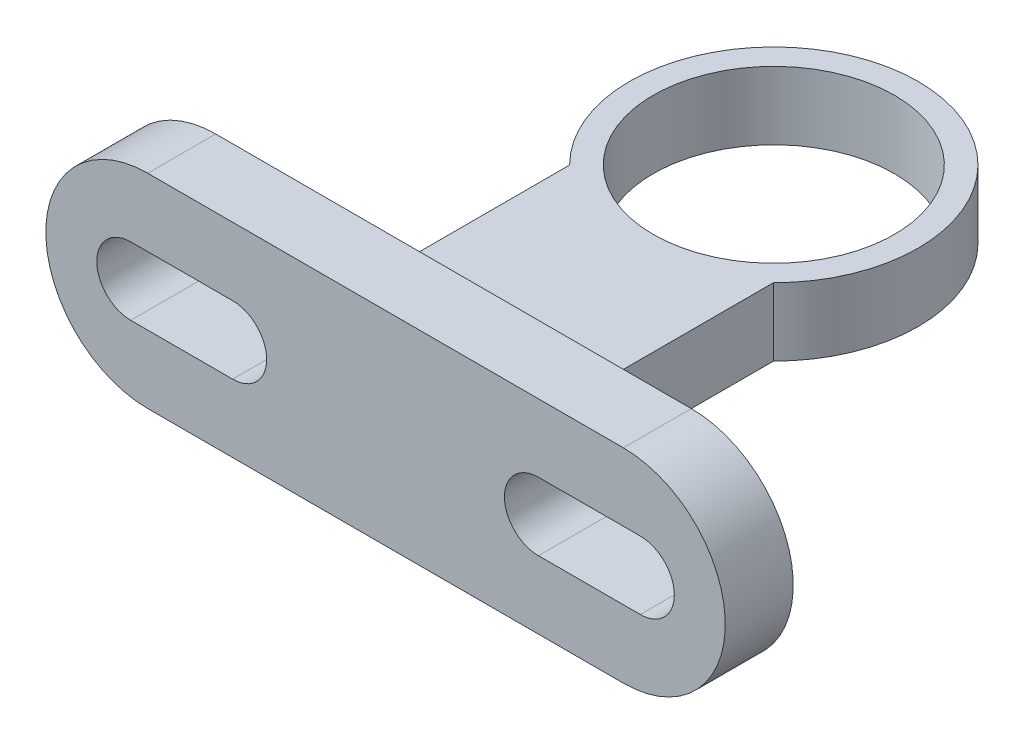
ISO-10303-21;
HEADER;
FILE_DESCRIPTION(('STEP AP214'),'2;1');
FILE_NAME('part.step','',(''),(''),'','','');
FILE_SCHEMA(('AUTOMOTIVE_DESIGN { 1 0 10303 214 1 1 1 1 }'));
ENDSEC;
DATA;
#1=APPLICATION_CONTEXT('core data for automotive mechanical design processes');
#2=APPLICATION_PROTOCOL_DEFINITION('international standard','automotive_design',2000,#1);
#3=PRODUCT_CONTEXT('',#1,'mechanical');
#4=PRODUCT('Part','Part','',(#3));
#5=PRODUCT_RELATED_PRODUCT_CATEGORY('part','',(#4));
#6=PRODUCT_DEFINITION_FORMATION('','',#4);
#7=PRODUCT_DEFINITION_CONTEXT('part definition',#1,'design');
#8=PRODUCT_DEFINITION('design','',#6,#7);
#9=PRODUCT_DEFINITION_SHAPE('','',#8);
#10=(LENGTH_UNIT() NAMED_UNIT(*) SI_UNIT(.MILLI.,.METRE.));
#11=(NAMED_UNIT(*) PLANE_ANGLE_UNIT() SI_UNIT($,.RADIAN.));
#12=(NAMED_UNIT(*) SI_UNIT($,.STERADIAN.) SOLID_ANGLE_UNIT());
#13=UNCERTAINTY_MEASURE_WITH_UNIT(LENGTH_MEASURE(1.E-05),#10,'distance_accuracy_value','');
#14=(GEOMETRIC_REPRESENTATION_CONTEXT(3) GLOBAL_UNCERTAINTY_ASSIGNED_CONTEXT((#13)) GLOBAL_UNIT_ASSIGNED_CONTEXT((#10,
#11,#12)) REPRESENTATION_CONTEXT('',''));
#15=CARTESIAN_POINT('',(0.,0.,0.));
#16=DIRECTION('',(0.,0.,1.));
#17=DIRECTION('',(1.,0.,0.));
#18=AXIS2_PLACEMENT_3D('',#15,#16,#17);
#19=CARTESIAN_POINT('',(0.,20.,0.));
#20=DIRECTION('',(0.,-1.,0.));
#21=DIRECTION('',(0.,0.,-1.));
#22=AXIS2_PLACEMENT_3D('',#19,#20,#21);
#23=CYLINDRICAL_SURFACE('',#22,42.5);
#24=DIRECTION('',(0.,-1.,0.));
#25=VECTOR('',#24,1.);
#26=CARTESIAN_POINT('',(-30.,20.,30.1039864469808));
#27=LINE('',#26,#25);
#28=CARTESIAN_POINT('',(-30.,20.,30.1039864469808));
#29=VERTEX_POINT('',#28);
#30=CARTESIAN_POINT('',(-30.,0.,30.1039864469808));
#31=VERTEX_POINT('',#30);
#32=EDGE_CURVE('E58',#29,#31,#27,.T.);
#33=ORIENTED_EDGE('',*,*,#32,.F.);
#34=CARTESIAN_POINT('',(0.,20.,0.));
#35=DIRECTION('',(0.,1.,0.));
#36=DIRECTION('',(0.,0.,1.));
#37=AXIS2_PLACEMENT_3D('',#34,#35,#36);
#38=CIRCLE('',#37,42.5);
#39=CARTESIAN_POINT('',(30.,20.,30.1039864469808));
#40=VERTEX_POINT('',#39);
#41=EDGE_CURVE('E11',#40,#29,#38,.T.);
#42=ORIENTED_EDGE('',*,*,#41,.F.);
#43=DIRECTION('',(0.,-1.,0.));
#44=VECTOR('',#43,1.);
#45=CARTESIAN_POINT('',(30.,20.,30.1039864469808));
#46=LINE('',#45,#44);
#47=CARTESIAN_POINT('',(30.,0.,30.1039864469808));
#48=VERTEX_POINT('',#47);
#49=EDGE_CURVE('E300',#40,#48,#46,.T.);
#50=ORIENTED_EDGE('',*,*,#49,.T.);
#51=CARTESIAN_POINT('',(0.,0.,0.));
#52=DIRECTION('',(0.,1.,0.));
#53=DIRECTION('',(0.,0.,1.));
#54=AXIS2_PLACEMENT_3D('',#51,#52,#53);
#55=CIRCLE('',#54,42.5);
#56=EDGE_CURVE('E42',#48,#31,#55,.T.);
#57=ORIENTED_EDGE('',*,*,#56,.T.);
#58=EDGE_LOOP('',(#33,#42,#50,#57));
#59=FACE_BOUND('',#58,.T.);
#60=ADVANCED_FACE('F39',(#59),#23,.T.);
#61=CARTESIAN_POINT('',(0.,20.,0.));
#62=DIRECTION('',(0.,1.,0.));
#63=DIRECTION('',(0.,0.,1.));
#64=AXIS2_PLACEMENT_3D('',#61,#62,#63);
#65=PLANE('',#64);
#66=ORIENTED_EDGE('',*,*,#41,.T.);
#67=DIRECTION('',(0.,0.,1.));
#68=VECTOR('',#67,1.);
#69=CARTESIAN_POINT('',(-30.,20.,94.285));
#70=LINE('',#69,#68);
#71=CARTESIAN_POINT('',(-30.,20.,94.285));
#72=VERTEX_POINT('',#71);
#73=EDGE_CURVE('E289',#29,#72,#70,.T.);
#74=ORIENTED_EDGE('',*,*,#73,.T.);
#75=DIRECTION('',(1.,0.,0.));
#76=VECTOR('',#75,1.);
#77=CARTESIAN_POINT('',(-30.,20.,94.285));
#78=LINE('',#77,#76);
#79=CARTESIAN_POINT('',(30.,20.,94.285));
#80=VERTEX_POINT('',#79);
#81=EDGE_CURVE('E292',#72,#80,#78,.T.);
#82=ORIENTED_EDGE('',*,*,#81,.T.);
#83=DIRECTION('',(0.,0.,-1.));
#84=VECTOR('',#83,1.);
#85=CARTESIAN_POINT('',(30.,20.,94.285));
#86=LINE('',#85,#84);
#87=EDGE_CURVE('E296',#80,#40,#86,.T.);
#88=ORIENTED_EDGE('',*,*,#87,.T.);
#89=EDGE_LOOP('',(#66,#74,#82,#88));
#90=FACE_BOUND('',#89,.T.);
#91=CARTESIAN_POINT('',(0.,20.,0.));
#92=DIRECTION('',(0.,1.,0.));
#93=DIRECTION('',(0.,0.,1.));
#94=AXIS2_PLACEMENT_3D('',#91,#92,#93);
#95=CIRCLE('',#94,35.5);
#96=CARTESIAN_POINT('',(0.,20.,35.5));
#97=VERTEX_POINT('',#96);
#98=EDGE_CURVE('E323',#97,#97,#95,.T.);
#99=ORIENTED_EDGE('',*,*,#98,.F.);
#100=EDGE_LOOP('',(#99));
#101=FACE_BOUND('',#100,.T.);
#102=ADVANCED_FACE('F345',(#90,#101),#65,.T.);
#103=CARTESIAN_POINT('',(0.,0.,0.));
#104=DIRECTION('',(0.,1.,0.));
#105=DIRECTION('',(0.,0.,1.));
#106=AXIS2_PLACEMENT_3D('',#103,#104,#105);
#107=PLANE('',#106);
#108=ORIENTED_EDGE('',*,*,#56,.F.);
#109=DIRECTION('',(0.,0.,-1.));
#110=VECTOR('',#109,1.);
#111=CARTESIAN_POINT('',(30.,0.,94.285));
#112=LINE('',#111,#110);
#113=CARTESIAN_POINT('',(30.,0.,94.285));
#114=VERTEX_POINT('',#113);
#115=EDGE_CURVE('E293',#114,#48,#112,.T.);
#116=ORIENTED_EDGE('',*,*,#115,.F.);
#117=DIRECTION('',(1.,0.,0.));
#118=VECTOR('',#117,1.);
#119=CARTESIAN_POINT('',(-30.,0.,94.285));
#120=LINE('',#119,#118);
#121=CARTESIAN_POINT('',(-30.,0.,94.285));
#122=VERTEX_POINT('',#121);
#123=EDGE_CURVE('E304',#122,#114,#120,.T.);
#124=ORIENTED_EDGE('',*,*,#123,.F.);
#125=DIRECTION('',(0.,0.,1.));
#126=VECTOR('',#125,1.);
#127=CARTESIAN_POINT('',(-30.,0.,94.285));
#128=LINE('',#127,#126);
#129=EDGE_CURVE('E288',#31,#122,#128,.T.);
#130=ORIENTED_EDGE('',*,*,#129,.F.);
#131=EDGE_LOOP('',(#108,#116,#124,#130));
#132=FACE_BOUND('',#131,.T.);
#133=CARTESIAN_POINT('',(0.,0.,0.));
#134=DIRECTION('',(0.,1.,0.));
#135=DIRECTION('',(0.,0.,1.));
#136=AXIS2_PLACEMENT_3D('',#133,#134,#135);
#137=CIRCLE('',#136,35.5);
#138=CARTESIAN_POINT('',(0.,0.,35.5));
#139=VERTEX_POINT('',#138);
#140=EDGE_CURVE('E322',#139,#139,#137,.T.);
#141=ORIENTED_EDGE('',*,*,#140,.T.);
#142=EDGE_LOOP('',(#141));
#143=FACE_BOUND('',#142,.T.);
#144=ADVANCED_FACE('F331',(#132,#143),#107,.F.);
#145=CARTESIAN_POINT('',(0.,20.,0.));
#146=DIRECTION('',(0.,-1.,0.));
#147=DIRECTION('',(0.,0.,-1.));
#148=AXIS2_PLACEMENT_3D('',#145,#146,#147);
#149=CYLINDRICAL_SURFACE('',#148,35.5);
#150=ORIENTED_EDGE('',*,*,#98,.T.);
#151=EDGE_LOOP('',(#150));
#152=FACE_BOUND('',#151,.T.);
#153=ORIENTED_EDGE('',*,*,#140,.F.);
#154=EDGE_LOOP('',(#153));
#155=FACE_BOUND('',#154,.T.);
#156=ADVANCED_FACE('F333',(#152,#155),#149,.F.);
#157=CARTESIAN_POINT('',(-30.,20.,94.285));
#158=DIRECTION('',(1.,0.,0.));
#159=DIRECTION('',(0.,0.,-1.));
#160=AXIS2_PLACEMENT_3D('',#157,#158,#159);
#161=PLANE('',#160);
#162=ORIENTED_EDGE('',*,*,#129,.T.);
#163=DIRECTION('',(0.,-1.,0.));
#164=VECTOR('',#163,1.);
#165=CARTESIAN_POINT('',(-30.,20.,94.285));
#166=LINE('',#165,#164);
#167=EDGE_CURVE('E316',#72,#122,#166,.T.);
#168=ORIENTED_EDGE('',*,*,#167,.F.);
#169=ORIENTED_EDGE('',*,*,#73,.F.);
#170=ORIENTED_EDGE('',*,*,#32,.T.);
#171=EDGE_LOOP('',(#162,#168,#169,#170));
#172=FACE_BOUND('',#171,.T.);
#173=ADVANCED_FACE('F335',(#172),#161,.F.);
#174=CARTESIAN_POINT('',(30.,20.,94.285));
#175=DIRECTION('',(-1.,0.,0.));
#176=DIRECTION('',(0.,0.,1.));
#177=AXIS2_PLACEMENT_3D('',#174,#175,#176);
#178=PLANE('',#177);
#179=ORIENTED_EDGE('',*,*,#115,.T.);
#180=ORIENTED_EDGE('',*,*,#49,.F.);
#181=ORIENTED_EDGE('',*,*,#87,.F.);
#182=DIRECTION('',(0.,-1.,0.));
#183=VECTOR('',#182,1.);
#184=CARTESIAN_POINT('',(30.,20.,94.285));
#185=LINE('',#184,#183);
#186=EDGE_CURVE('E313',#80,#114,#185,.T.);
#187=ORIENTED_EDGE('',*,*,#186,.T.);
#188=EDGE_LOOP('',(#179,#180,#181,#187));
#189=FACE_BOUND('',#188,.T.);
#190=ADVANCED_FACE('F342',(#189),#178,.F.);
#191=CARTESIAN_POINT('',(70.,10.,94.285));
#192=DIRECTION('',(0.,0.,1.));
#193=DIRECTION('',(1.,0.,0.));
#194=AXIS2_PLACEMENT_3D('',#191,#192,#193);
#195=PLANE('',#194);
#196=CARTESIAN_POINT('',(-45.,10.,94.285));
#197=DIRECTION('',(0.,0.,1.));
#198=DIRECTION('',(1.,0.,0.));
#199=AXIS2_PLACEMENT_3D('',#196,#197,#198);
#200=CIRCLE('',#199,10.);
#201=CARTESIAN_POINT('',(-45.,0.,94.285));
#202=VERTEX_POINT('',#201);
#203=CARTESIAN_POINT('',(-45.,20.,94.285));
#204=VERTEX_POINT('',#203);
#205=EDGE_CURVE('E170',#202,#204,#200,.T.);
#206=ORIENTED_EDGE('',*,*,#205,.T.);
#207=DIRECTION('',(-1.,0.,0.));
#208=VECTOR('',#207,1.);
#209=CARTESIAN_POINT('',(-45.,20.,94.285));
#210=LINE('',#209,#208);
#211=CARTESIAN_POINT('',(-75.,20.,94.285));
#212=VERTEX_POINT('',#211);
#213=EDGE_CURVE('E222',#204,#212,#210,.T.);
#214=ORIENTED_EDGE('',*,*,#213,.T.);
#215=CARTESIAN_POINT('',(-75.,10.,94.285));
#216=DIRECTION('',(0.,0.,1.));
#217=DIRECTION('',(1.,0.,0.));
#218=AXIS2_PLACEMENT_3D('',#215,#216,#217);
#219=CIRCLE('',#218,10.);
#220=CARTESIAN_POINT('',(-75.,0.,94.285));
#221=VERTEX_POINT('',#220);
#222=EDGE_CURVE('E226',#212,#221,#219,.T.);
#223=ORIENTED_EDGE('',*,*,#222,.T.);
#224=DIRECTION('',(1.,0.,0.));
#225=VECTOR('',#224,1.);
#226=CARTESIAN_POINT('',(-45.,0.,94.285));
#227=LINE('',#226,#225);
#228=EDGE_CURVE('E208',#221,#202,#227,.T.);
#229=ORIENTED_EDGE('',*,*,#228,.T.);
#230=EDGE_LOOP('',(#206,#214,#223,#229));
#231=FACE_BOUND('',#230,.T.);
#232=CARTESIAN_POINT('',(70.,10.,94.285));
#233=DIRECTION('',(0.,0.,1.));
#234=DIRECTION('',(1.,0.,0.));
#235=AXIS2_PLACEMENT_3D('',#232,#233,#234);
#236=CIRCLE('',#235,30.);
#237=CARTESIAN_POINT('',(70.,-20.,94.285));
#238=VERTEX_POINT('',#237);
#239=CARTESIAN_POINT('',(70.,40.,94.285));
#240=VERTEX_POINT('',#239);
#241=EDGE_CURVE('E246',#238,#240,#236,.T.);
#242=ORIENTED_EDGE('',*,*,#241,.F.);
#243=DIRECTION('',(1.,0.,0.));
#244=VECTOR('',#243,1.);
#245=CARTESIAN_POINT('',(70.,-20.,94.285));
#246=LINE('',#245,#244);
#247=CARTESIAN_POINT('',(-70.,-20.,94.285));
#248=VERTEX_POINT('',#247);
#249=EDGE_CURVE('E252',#248,#238,#246,.T.);
#250=ORIENTED_EDGE('',*,*,#249,.F.);
#251=CARTESIAN_POINT('',(-70.,9.99999999999999,94.285));
#252=DIRECTION('',(0.,0.,1.));
#253=DIRECTION('',(1.,0.,0.));
#254=AXIS2_PLACEMENT_3D('',#251,#252,#253);
#255=CIRCLE('',#254,30.);
#256=CARTESIAN_POINT('',(-70.,40.,94.285));
#257=VERTEX_POINT('',#256);
#258=EDGE_CURVE('E268',#257,#248,#255,.T.);
#259=ORIENTED_EDGE('',*,*,#258,.F.);
#260=DIRECTION('',(-1.,0.,0.));
#261=VECTOR('',#260,1.);
#262=CARTESIAN_POINT('',(70.,40.,94.285));
#263=LINE('',#262,#261);
#264=EDGE_CURVE('E265',#240,#257,#263,.T.);
#265=ORIENTED_EDGE('',*,*,#264,.F.);
#266=EDGE_LOOP('',(#242,#250,#259,#265));
#267=FACE_BOUND('',#266,.T.);
#268=CARTESIAN_POINT('',(45.,10.,94.285));
#269=DIRECTION('',(0.,0.,1.));
#270=DIRECTION('',(-1.,0.,0.));
#271=AXIS2_PLACEMENT_3D('',#268,#269,#270);
#272=CIRCLE('',#271,10.);
#273=CARTESIAN_POINT('',(45.,20.,94.285));
#274=VERTEX_POINT('',#273);
#275=CARTESIAN_POINT('',(45.,0.,94.285));
#276=VERTEX_POINT('',#275);
#277=EDGE_CURVE('E185',#274,#276,#272,.T.);
#278=ORIENTED_EDGE('',*,*,#277,.T.);
#279=DIRECTION('',(1.,0.,0.));
#280=VECTOR('',#279,1.);
#281=CARTESIAN_POINT('',(45.,0.,94.285));
#282=LINE('',#281,#280);
#283=CARTESIAN_POINT('',(75.,0.,94.285));
#284=VERTEX_POINT('',#283);
#285=EDGE_CURVE('E168',#276,#284,#282,.T.);
#286=ORIENTED_EDGE('',*,*,#285,.T.);
#287=CARTESIAN_POINT('',(75.,10.,94.285));
#288=DIRECTION('',(0.,0.,1.));
#289=DIRECTION('',(-1.,0.,0.));
#290=AXIS2_PLACEMENT_3D('',#287,#288,#289);
#291=CIRCLE('',#290,10.);
#292=CARTESIAN_POINT('',(75.,20.,94.285));
#293=VERTEX_POINT('',#292);
#294=EDGE_CURVE('E190',#284,#293,#291,.T.);
#295=ORIENTED_EDGE('',*,*,#294,.T.);
#296=DIRECTION('',(-1.,0.,0.));
#297=VECTOR('',#296,1.);
#298=CARTESIAN_POINT('',(45.,20.,94.285));
#299=LINE('',#298,#297);
#300=EDGE_CURVE('E162',#293,#274,#299,.T.);
#301=ORIENTED_EDGE('',*,*,#300,.T.);
#302=EDGE_LOOP('',(#278,#286,#295,#301));
#303=FACE_BOUND('',#302,.T.);
#304=ORIENTED_EDGE('',*,*,#167,.T.);
#305=ORIENTED_EDGE('',*,*,#123,.T.);
#306=ORIENTED_EDGE('',*,*,#186,.F.);
#307=ORIENTED_EDGE('',*,*,#81,.F.);
#308=EDGE_LOOP('',(#304,#305,#306,#307));
#309=FACE_BOUND('',#308,.T.);
#310=ADVANCED_FACE('F364',(#231,#267,#303,#309),#195,.F.);
#311=CARTESIAN_POINT('',(70.,10.,114.285));
#312=DIRECTION('',(0.,0.,1.));
#313=DIRECTION('',(1.,0.,0.));
#314=AXIS2_PLACEMENT_3D('',#311,#312,#313);
#315=PLANE('',#314);
#316=CARTESIAN_POINT('',(70.,10.,114.285));
#317=DIRECTION('',(0.,0.,1.));
#318=DIRECTION('',(1.,0.,0.));
#319=AXIS2_PLACEMENT_3D('',#316,#317,#318);
#320=CIRCLE('',#319,30.);
#321=CARTESIAN_POINT('',(70.,-20.,114.285));
#322=VERTEX_POINT('',#321);
#323=CARTESIAN_POINT('',(70.,40.,114.285));
#324=VERTEX_POINT('',#323);
#325=EDGE_CURVE('E247',#322,#324,#320,.T.);
#326=ORIENTED_EDGE('',*,*,#325,.T.);
#327=DIRECTION('',(-1.,0.,0.));
#328=VECTOR('',#327,1.);
#329=CARTESIAN_POINT('',(70.,40.,114.285));
#330=LINE('',#329,#328);
#331=CARTESIAN_POINT('',(-70.,40.,114.285));
#332=VERTEX_POINT('',#331);
#333=EDGE_CURVE('E251',#324,#332,#330,.T.);
#334=ORIENTED_EDGE('',*,*,#333,.T.);
#335=CARTESIAN_POINT('',(-70.,9.99999999999999,114.285));
#336=DIRECTION('',(0.,0.,1.));
#337=DIRECTION('',(1.,0.,0.));
#338=AXIS2_PLACEMENT_3D('',#335,#336,#337);
#339=CIRCLE('',#338,30.);
#340=CARTESIAN_POINT('',(-70.,-20.,114.285));
#341=VERTEX_POINT('',#340);
#342=EDGE_CURVE('E255',#332,#341,#339,.T.);
#343=ORIENTED_EDGE('',*,*,#342,.T.);
#344=DIRECTION('',(1.,0.,0.));
#345=VECTOR('',#344,1.);
#346=CARTESIAN_POINT('',(70.,-20.,114.285));
#347=LINE('',#346,#345);
#348=EDGE_CURVE('E258',#341,#322,#347,.T.);
#349=ORIENTED_EDGE('',*,*,#348,.T.);
#350=EDGE_LOOP('',(#326,#334,#343,#349));
#351=FACE_BOUND('',#350,.T.);
#352=DIRECTION('',(-1.,0.,0.));
#353=VECTOR('',#352,1.);
#354=CARTESIAN_POINT('',(-45.,20.,114.285));
#355=LINE('',#354,#353);
#356=CARTESIAN_POINT('',(-45.,20.,114.285));
#357=VERTEX_POINT('',#356);
#358=CARTESIAN_POINT('',(-75.,20.,114.285));
#359=VERTEX_POINT('',#358);
#360=EDGE_CURVE('E207',#357,#359,#355,.T.);
#361=ORIENTED_EDGE('',*,*,#360,.F.);
#362=CARTESIAN_POINT('',(-45.,10.,114.285));
#363=DIRECTION('',(0.,0.,1.));
#364=DIRECTION('',(1.,0.,0.));
#365=AXIS2_PLACEMENT_3D('',#362,#363,#364);
#366=CIRCLE('',#365,10.);
#367=CARTESIAN_POINT('',(-45.,0.,114.285));
#368=VERTEX_POINT('',#367);
#369=EDGE_CURVE('E204',#368,#357,#366,.T.);
#370=ORIENTED_EDGE('',*,*,#369,.F.);
#371=DIRECTION('',(1.,0.,0.));
#372=VECTOR('',#371,1.);
#373=CARTESIAN_POINT('',(-45.,0.,114.285));
#374=LINE('',#373,#372);
#375=CARTESIAN_POINT('',(-75.,0.,114.285));
#376=VERTEX_POINT('',#375);
#377=EDGE_CURVE('E215',#376,#368,#374,.T.);
#378=ORIENTED_EDGE('',*,*,#377,.F.);
#379=CARTESIAN_POINT('',(-75.,10.,114.285));
#380=DIRECTION('',(0.,0.,1.));
#381=DIRECTION('',(1.,0.,0.));
#382=AXIS2_PLACEMENT_3D('',#379,#380,#381);
#383=CIRCLE('',#382,10.);
#384=EDGE_CURVE('E211',#359,#376,#383,.T.);
#385=ORIENTED_EDGE('',*,*,#384,.F.);
#386=EDGE_LOOP('',(#361,#370,#378,#385));
#387=FACE_BOUND('',#386,.T.);
#388=DIRECTION('',(1.,0.,0.));
#389=VECTOR('',#388,1.);
#390=CARTESIAN_POINT('',(45.,0.,114.285));
#391=LINE('',#390,#389);
#392=CARTESIAN_POINT('',(45.,0.,114.285));
#393=VERTEX_POINT('',#392);
#394=CARTESIAN_POINT('',(75.,0.,114.285));
#395=VERTEX_POINT('',#394);
#396=EDGE_CURVE('E161',#393,#395,#391,.T.);
#397=ORIENTED_EDGE('',*,*,#396,.F.);
#398=CARTESIAN_POINT('',(45.,10.,114.285));
#399=DIRECTION('',(0.,0.,1.));
#400=DIRECTION('',(-1.,0.,0.));
#401=AXIS2_PLACEMENT_3D('',#398,#399,#400);
#402=CIRCLE('',#401,10.);
#403=CARTESIAN_POINT('',(45.,20.,114.285));
#404=VERTEX_POINT('',#403);
#405=EDGE_CURVE('E150',#404,#393,#402,.T.);
#406=ORIENTED_EDGE('',*,*,#405,.F.);
#407=DIRECTION('',(-1.,0.,0.));
#408=VECTOR('',#407,1.);
#409=CARTESIAN_POINT('',(45.,20.,114.285));
#410=LINE('',#409,#408);
#411=CARTESIAN_POINT('',(75.,20.,114.285));
#412=VERTEX_POINT('',#411);
#413=EDGE_CURVE('E180',#412,#404,#410,.T.);
#414=ORIENTED_EDGE('',*,*,#413,.F.);
#415=CARTESIAN_POINT('',(75.,10.,114.285));
#416=DIRECTION('',(0.,0.,1.));
#417=DIRECTION('',(-1.,0.,0.));
#418=AXIS2_PLACEMENT_3D('',#415,#416,#417);
#419=CIRCLE('',#418,10.);
#420=EDGE_CURVE('E176',#395,#412,#419,.T.);
#421=ORIENTED_EDGE('',*,*,#420,.F.);
#422=EDGE_LOOP('',(#397,#406,#414,#421));
#423=FACE_BOUND('',#422,.T.);
#424=ADVANCED_FACE('F174',(#351,#387,#423),#315,.T.);
#425=CARTESIAN_POINT('',(70.,10.,114.285));
#426=DIRECTION('',(0.,0.,-1.));
#427=DIRECTION('',(-1.,0.,0.));
#428=AXIS2_PLACEMENT_3D('',#425,#426,#427);
#429=CYLINDRICAL_SURFACE('',#428,30.);
#430=ORIENTED_EDGE('',*,*,#241,.T.);
#431=DIRECTION('',(0.,0.,-1.));
#432=VECTOR('',#431,1.);
#433=CARTESIAN_POINT('',(70.,40.,114.285));
#434=LINE('',#433,#432);
#435=EDGE_CURVE('E284',#324,#240,#434,.T.);
#436=ORIENTED_EDGE('',*,*,#435,.F.);
#437=ORIENTED_EDGE('',*,*,#325,.F.);
#438=DIRECTION('',(0.,0.,-1.));
#439=VECTOR('',#438,1.);
#440=CARTESIAN_POINT('',(70.,-20.,114.285));
#441=LINE('',#440,#439);
#442=EDGE_CURVE('E261',#322,#238,#441,.T.);
#443=ORIENTED_EDGE('',*,*,#442,.T.);
#444=EDGE_LOOP('',(#430,#436,#437,#443));
#445=FACE_BOUND('',#444,.T.);
#446=ADVANCED_FACE('F376',(#445),#429,.T.);
#447=CARTESIAN_POINT('',(70.,40.,114.285));
#448=DIRECTION('',(0.,-1.,0.));
#449=DIRECTION('',(0.,0.,-1.));
#450=AXIS2_PLACEMENT_3D('',#447,#448,#449);
#451=PLANE('',#450);
#452=ORIENTED_EDGE('',*,*,#264,.T.);
#453=DIRECTION('',(0.,0.,-1.));
#454=VECTOR('',#453,1.);
#455=CARTESIAN_POINT('',(-70.,40.,114.285));
#456=LINE('',#455,#454);
#457=EDGE_CURVE('E280',#332,#257,#456,.T.);
#458=ORIENTED_EDGE('',*,*,#457,.F.);
#459=ORIENTED_EDGE('',*,*,#333,.F.);
#460=ORIENTED_EDGE('',*,*,#435,.T.);
#461=EDGE_LOOP('',(#452,#458,#459,#460));
#462=FACE_BOUND('',#461,.T.);
#463=ADVANCED_FACE('F379',(#462),#451,.F.);
#464=CARTESIAN_POINT('',(-70.,9.99999999999999,114.285));
#465=DIRECTION('',(0.,0.,-1.));
#466=DIRECTION('',(-1.,0.,0.));
#467=AXIS2_PLACEMENT_3D('',#464,#465,#466);
#468=CYLINDRICAL_SURFACE('',#467,30.);
#469=ORIENTED_EDGE('',*,*,#258,.T.);
#470=DIRECTION('',(0.,0.,-1.));
#471=VECTOR('',#470,1.);
#472=CARTESIAN_POINT('',(-70.,-20.,114.285));
#473=LINE('',#472,#471);
#474=EDGE_CURVE('E276',#341,#248,#473,.T.);
#475=ORIENTED_EDGE('',*,*,#474,.F.);
#476=ORIENTED_EDGE('',*,*,#342,.F.);
#477=ORIENTED_EDGE('',*,*,#457,.T.);
#478=EDGE_LOOP('',(#469,#475,#476,#477));
#479=FACE_BOUND('',#478,.T.);
#480=ADVANCED_FACE('F383',(#479),#468,.T.);
#481=CARTESIAN_POINT('',(70.,-20.,114.285));
#482=DIRECTION('',(0.,1.,0.));
#483=DIRECTION('',(0.,0.,1.));
#484=AXIS2_PLACEMENT_3D('',#481,#482,#483);
#485=PLANE('',#484);
#486=ORIENTED_EDGE('',*,*,#249,.T.);
#487=ORIENTED_EDGE('',*,*,#442,.F.);
#488=ORIENTED_EDGE('',*,*,#348,.F.);
#489=ORIENTED_EDGE('',*,*,#474,.T.);
#490=EDGE_LOOP('',(#486,#487,#488,#489));
#491=FACE_BOUND('',#490,.T.);
#492=ADVANCED_FACE('F387',(#491),#485,.F.);
#493=CARTESIAN_POINT('',(-45.,10.,114.285));
#494=DIRECTION('',(0.,0.,-1.));
#495=DIRECTION('',(-1.,0.,0.));
#496=AXIS2_PLACEMENT_3D('',#493,#494,#495);
#497=CYLINDRICAL_SURFACE('',#496,10.);
#498=ORIENTED_EDGE('',*,*,#205,.F.);
#499=DIRECTION('',(0.,0.,-1.));
#500=VECTOR('',#499,1.);
#501=CARTESIAN_POINT('',(-45.,0.,114.285));
#502=LINE('',#501,#500);
#503=EDGE_CURVE('E218',#368,#202,#502,.T.);
#504=ORIENTED_EDGE('',*,*,#503,.F.);
#505=ORIENTED_EDGE('',*,*,#369,.T.);
#506=DIRECTION('',(0.,0.,-1.));
#507=VECTOR('',#506,1.);
#508=CARTESIAN_POINT('',(-45.,20.,114.285));
#509=LINE('',#508,#507);
#510=EDGE_CURVE('E242',#357,#204,#509,.T.);
#511=ORIENTED_EDGE('',*,*,#510,.T.);
#512=EDGE_LOOP('',(#498,#504,#505,#511));
#513=FACE_BOUND('',#512,.T.);
#514=ADVANCED_FACE('F390',(#513),#497,.F.);
#515=CARTESIAN_POINT('',(-45.,20.,114.285));
#516=DIRECTION('',(0.,-1.,0.));
#517=DIRECTION('',(1.,0.,0.));
#518=AXIS2_PLACEMENT_3D('',#515,#516,#517);
#519=PLANE('',#518);
#520=ORIENTED_EDGE('',*,*,#213,.F.);
#521=ORIENTED_EDGE('',*,*,#510,.F.);
#522=ORIENTED_EDGE('',*,*,#360,.T.);
#523=DIRECTION('',(0.,0.,-1.));
#524=VECTOR('',#523,1.);
#525=CARTESIAN_POINT('',(-75.,20.,114.285));
#526=LINE('',#525,#524);
#527=EDGE_CURVE('E239',#359,#212,#526,.T.);
#528=ORIENTED_EDGE('',*,*,#527,.T.);
#529=EDGE_LOOP('',(#520,#521,#522,#528));
#530=FACE_BOUND('',#529,.T.);
#531=ADVANCED_FACE('F398',(#530),#519,.T.);
#532=CARTESIAN_POINT('',(-75.,10.,114.285));
#533=DIRECTION('',(0.,0.,-1.));
#534=DIRECTION('',(-1.,0.,0.));
#535=AXIS2_PLACEMENT_3D('',#532,#533,#534);
#536=CYLINDRICAL_SURFACE('',#535,10.);
#537=ORIENTED_EDGE('',*,*,#222,.F.);
#538=ORIENTED_EDGE('',*,*,#527,.F.);
#539=ORIENTED_EDGE('',*,*,#384,.T.);
#540=DIRECTION('',(0.,0.,-1.));
#541=VECTOR('',#540,1.);
#542=CARTESIAN_POINT('',(-75.,0.,114.285));
#543=LINE('',#542,#541);
#544=EDGE_CURVE('E236',#376,#221,#543,.T.);
#545=ORIENTED_EDGE('',*,*,#544,.T.);
#546=EDGE_LOOP('',(#537,#538,#539,#545));
#547=FACE_BOUND('',#546,.T.);
#548=ADVANCED_FACE('F402',(#547),#536,.F.);
#549=CARTESIAN_POINT('',(-45.,0.,114.285));
#550=DIRECTION('',(0.,1.,0.));
#551=DIRECTION('',(-1.,0.,0.));
#552=AXIS2_PLACEMENT_3D('',#549,#550,#551);
#553=PLANE('',#552);
#554=ORIENTED_EDGE('',*,*,#228,.F.);
#555=ORIENTED_EDGE('',*,*,#544,.F.);
#556=ORIENTED_EDGE('',*,*,#377,.T.);
#557=ORIENTED_EDGE('',*,*,#503,.T.);
#558=EDGE_LOOP('',(#554,#555,#556,#557));
#559=FACE_BOUND('',#558,.T.);
#560=ADVANCED_FACE('F406',(#559),#553,.T.);
#561=CARTESIAN_POINT('',(45.,10.,114.285));
#562=DIRECTION('',(0.,0.,-1.));
#563=DIRECTION('',(-1.,0.,0.));
#564=AXIS2_PLACEMENT_3D('',#561,#562,#563);
#565=CYLINDRICAL_SURFACE('',#564,10.);
#566=ORIENTED_EDGE('',*,*,#277,.F.);
#567=DIRECTION('',(0.,0.,-1.));
#568=VECTOR('',#567,1.);
#569=CARTESIAN_POINT('',(45.,20.,114.285));
#570=LINE('',#569,#568);
#571=EDGE_CURVE('E156',#404,#274,#570,.T.);
#572=ORIENTED_EDGE('',*,*,#571,.F.);
#573=ORIENTED_EDGE('',*,*,#405,.T.);
#574=DIRECTION('',(0.,0.,-1.));
#575=VECTOR('',#574,1.);
#576=CARTESIAN_POINT('',(45.,0.,114.285));
#577=LINE('',#576,#575);
#578=EDGE_CURVE('E153',#393,#276,#577,.T.);
#579=ORIENTED_EDGE('',*,*,#578,.T.);
#580=EDGE_LOOP('',(#566,#572,#573,#579));
#581=FACE_BOUND('',#580,.T.);
#582=ADVANCED_FACE('F152',(#581),#565,.F.);
#583=CARTESIAN_POINT('',(45.,0.,114.285));
#584=DIRECTION('',(0.,1.,0.));
#585=DIRECTION('',(-1.,0.,0.));
#586=AXIS2_PLACEMENT_3D('',#583,#584,#585);
#587=PLANE('',#586);
#588=ORIENTED_EDGE('',*,*,#285,.F.);
#589=ORIENTED_EDGE('',*,*,#578,.F.);
#590=ORIENTED_EDGE('',*,*,#396,.T.);
#591=DIRECTION('',(0.,0.,-1.));
#592=VECTOR('',#591,1.);
#593=CARTESIAN_POINT('',(75.,0.,114.285));
#594=LINE('',#593,#592);
#595=EDGE_CURVE('E171',#395,#284,#594,.T.);
#596=ORIENTED_EDGE('',*,*,#595,.T.);
#597=EDGE_LOOP('',(#588,#589,#590,#596));
#598=FACE_BOUND('',#597,.T.);
#599=ADVANCED_FACE('F165',(#598),#587,.T.);
#600=CARTESIAN_POINT('',(75.,10.,114.285));
#601=DIRECTION('',(0.,0.,-1.));
#602=DIRECTION('',(-1.,0.,0.));
#603=AXIS2_PLACEMENT_3D('',#600,#601,#602);
#604=CYLINDRICAL_SURFACE('',#603,10.);
#605=ORIENTED_EDGE('',*,*,#294,.F.);
#606=ORIENTED_EDGE('',*,*,#595,.F.);
#607=ORIENTED_EDGE('',*,*,#420,.T.);
#608=DIRECTION('',(0.,0.,-1.));
#609=VECTOR('',#608,1.);
#610=CARTESIAN_POINT('',(75.,20.,114.285));
#611=LINE('',#610,#609);
#612=EDGE_CURVE('E199',#412,#293,#611,.T.);
#613=ORIENTED_EDGE('',*,*,#612,.T.);
#614=EDGE_LOOP('',(#605,#606,#607,#613));
#615=FACE_BOUND('',#614,.T.);
#616=ADVANCED_FACE('F415',(#615),#604,.F.);
#617=CARTESIAN_POINT('',(45.,20.,114.285));
#618=DIRECTION('',(0.,-1.,0.));
#619=DIRECTION('',(1.,0.,0.));
#620=AXIS2_PLACEMENT_3D('',#617,#618,#619);
#621=PLANE('',#620);
#622=ORIENTED_EDGE('',*,*,#300,.F.);
#623=ORIENTED_EDGE('',*,*,#612,.F.);
#624=ORIENTED_EDGE('',*,*,#413,.T.);
#625=ORIENTED_EDGE('',*,*,#571,.T.);
#626=EDGE_LOOP('',(#622,#623,#624,#625));
#627=FACE_BOUND('',#626,.T.);
#628=ADVANCED_FACE('F418',(#627),#621,.T.);
#629=CLOSED_SHELL('',(#60,#102,#144,#156,#173,#190,#310,#424,#446,#463,#480,#492,#514,#531,#548,
#560,#582,#599,#616,#628));
#630=MANIFOLD_SOLID_BREP('B2',#629);
#631=ADVANCED_BREP_SHAPE_REPRESENTATION('',(#18,#630),#14);
#632=SHAPE_DEFINITION_REPRESENTATION(#9,#631);
ENDSEC;
END-ISO-10303-21;
